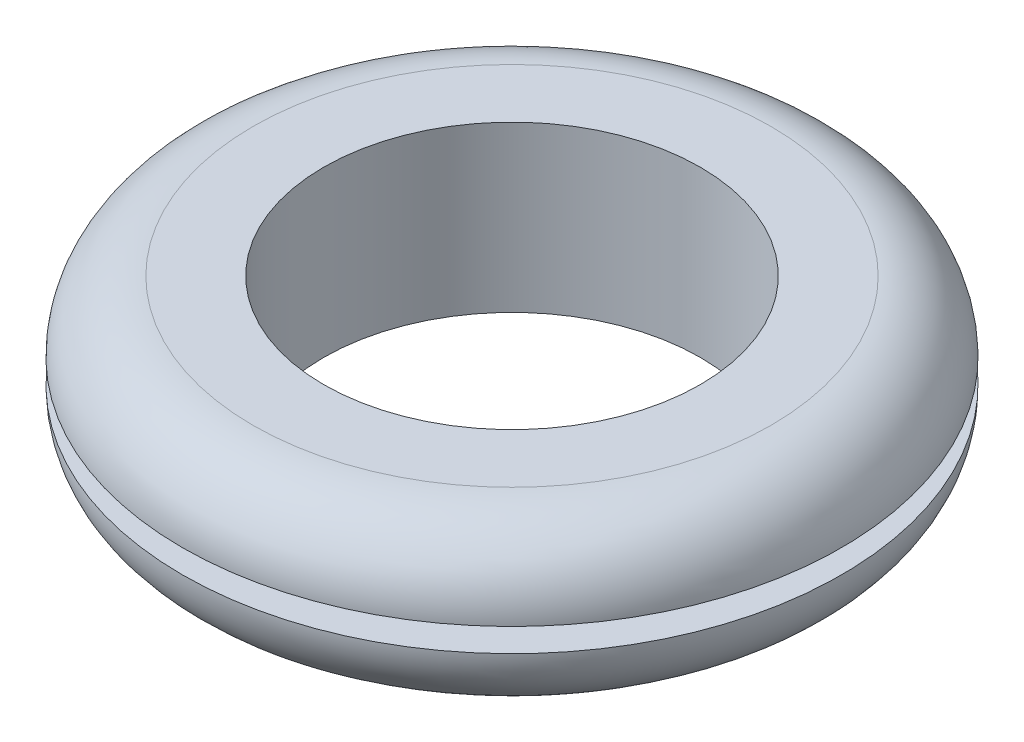
ISO-10303-21;
HEADER;
FILE_DESCRIPTION(('STEP AP214'),'2;1');
FILE_NAME('part.step','',(''),(''),'','','');
FILE_SCHEMA(('AUTOMOTIVE_DESIGN { 1 0 10303 214 1 1 1 1 }'));
ENDSEC;
DATA;
#1=APPLICATION_CONTEXT('core data for automotive mechanical design processes');
#2=APPLICATION_PROTOCOL_DEFINITION('international standard','automotive_design',2000,#1);
#3=PRODUCT_CONTEXT('',#1,'mechanical');
#4=PRODUCT('Part','Part','',(#3));
#5=PRODUCT_RELATED_PRODUCT_CATEGORY('part','',(#4));
#6=PRODUCT_DEFINITION_FORMATION('','',#4);
#7=PRODUCT_DEFINITION_CONTEXT('part definition',#1,'design');
#8=PRODUCT_DEFINITION('design','',#6,#7);
#9=PRODUCT_DEFINITION_SHAPE('','',#8);
#10=(LENGTH_UNIT() NAMED_UNIT(*) SI_UNIT(.MILLI.,.METRE.));
#11=(NAMED_UNIT(*) PLANE_ANGLE_UNIT() SI_UNIT($,.RADIAN.));
#12=(NAMED_UNIT(*) SI_UNIT($,.STERADIAN.) SOLID_ANGLE_UNIT());
#13=UNCERTAINTY_MEASURE_WITH_UNIT(LENGTH_MEASURE(1.E-05),#10,'distance_accuracy_value','');
#14=(GEOMETRIC_REPRESENTATION_CONTEXT(3) GLOBAL_UNCERTAINTY_ASSIGNED_CONTEXT((#13)) GLOBAL_UNIT_ASSIGNED_CONTEXT((#10,
#11,#12)) REPRESENTATION_CONTEXT('',''));
#15=CARTESIAN_POINT('',(0.,0.,0.));
#16=DIRECTION('',(0.,0.,1.));
#17=DIRECTION('',(1.,0.,0.));
#18=AXIS2_PLACEMENT_3D('',#15,#16,#17);
#19=CARTESIAN_POINT('',(0.,-5.55625,12.7));
#20=DIRECTION('',(0.,1.,0.));
#21=DIRECTION('',(0.,0.,1.));
#22=AXIS2_PLACEMENT_3D('',#19,#20,#21);
#23=PLANE('',#22);
#24=CARTESIAN_POINT('',(0.,-5.55625,0.));
#25=DIRECTION('',(0.,-1.,0.));
#26=DIRECTION('',(0.,0.,-1.));
#27=AXIS2_PLACEMENT_3D('',#24,#25,#26);
#28=CIRCLE('',#27,12.7);
#29=CARTESIAN_POINT('',(0.,-5.55625,-12.7));
#30=VERTEX_POINT('',#29);
#31=EDGE_CURVE('E10',#30,#30,#28,.T.);
#32=ORIENTED_EDGE('',*,*,#31,.F.);
#33=EDGE_LOOP('',(#32));
#34=FACE_BOUND('',#33,.T.);
#35=CARTESIAN_POINT('',(0.,-5.55625,0.));
#36=DIRECTION('',(0.,-1.,0.));
#37=DIRECTION('',(0.,0.,-1.));
#38=AXIS2_PLACEMENT_3D('',#35,#36,#37);
#39=CIRCLE('',#38,17.4625);
#40=CARTESIAN_POINT('',(0.,-5.55625,-17.4625));
#41=VERTEX_POINT('',#40);
#42=EDGE_CURVE('E58',#41,#41,#39,.T.);
#43=ORIENTED_EDGE('',*,*,#42,.T.);
#44=EDGE_LOOP('',(#43));
#45=FACE_BOUND('',#44,.T.);
#46=ADVANCED_FACE('F30',(#34,#45),#23,.F.);
#47=CARTESIAN_POINT('',(0.,-5.55625,0.));
#48=DIRECTION('',(0.,-1.,0.));
#49=DIRECTION('',(0.,0.,-1.));
#50=AXIS2_PLACEMENT_3D('',#47,#48,#49);
#51=CYLINDRICAL_SURFACE('',#50,12.7);
#52=CARTESIAN_POINT('',(0.,5.55625,0.));
#53=DIRECTION('',(0.,-1.,0.));
#54=DIRECTION('',(0.,0.,-1.));
#55=AXIS2_PLACEMENT_3D('',#52,#53,#54);
#56=CIRCLE('',#55,12.7);
#57=CARTESIAN_POINT('',(0.,5.55625,-12.7));
#58=VERTEX_POINT('',#57);
#59=EDGE_CURVE('E36',#58,#58,#56,.T.);
#60=ORIENTED_EDGE('',*,*,#59,.F.);
#61=EDGE_LOOP('',(#60));
#62=FACE_BOUND('',#61,.T.);
#63=ORIENTED_EDGE('',*,*,#31,.T.);
#64=EDGE_LOOP('',(#63));
#65=FACE_BOUND('',#64,.T.);
#66=ADVANCED_FACE('F95',(#62,#65),#51,.F.);
#67=CARTESIAN_POINT('',(0.,5.55625,12.7));
#68=DIRECTION('',(0.,-1.,0.));
#69=DIRECTION('',(0.,0.,-1.));
#70=AXIS2_PLACEMENT_3D('',#67,#68,#69);
#71=PLANE('',#70);
#72=CARTESIAN_POINT('',(0.,5.55625,0.));
#73=DIRECTION('',(0.,-1.,0.));
#74=DIRECTION('',(0.,0.,-1.));
#75=AXIS2_PLACEMENT_3D('',#72,#73,#74);
#76=CIRCLE('',#75,17.4625);
#77=CARTESIAN_POINT('',(0.,5.55625,-17.4625));
#78=VERTEX_POINT('',#77);
#79=EDGE_CURVE('E40',#78,#78,#76,.T.);
#80=ORIENTED_EDGE('',*,*,#79,.F.);
#81=EDGE_LOOP('',(#80));
#82=FACE_BOUND('',#81,.T.);
#83=ORIENTED_EDGE('',*,*,#59,.T.);
#84=EDGE_LOOP('',(#83));
#85=FACE_BOUND('',#84,.T.);
#86=ADVANCED_FACE('F90',(#82,#85),#71,.F.);
#87=CARTESIAN_POINT('',(0.,0.79375,0.));
#88=DIRECTION('',(0.,-1.,0.));
#89=DIRECTION('',(0.,0.,-1.));
#90=AXIS2_PLACEMENT_3D('',#87,#88,#89);
#91=TOROIDAL_SURFACE('',#90,17.4625,4.7625);
#92=CARTESIAN_POINT('',(0.,0.79375,0.));
#93=DIRECTION('',(0.,-1.,0.));
#94=DIRECTION('',(0.,0.,-1.));
#95=AXIS2_PLACEMENT_3D('',#92,#93,#94);
#96=CIRCLE('',#95,22.225);
#97=CARTESIAN_POINT('',(0.,0.79375,-22.225));
#98=VERTEX_POINT('',#97);
#99=EDGE_CURVE('E44',#98,#98,#96,.T.);
#100=ORIENTED_EDGE('',*,*,#99,.F.);
#101=EDGE_LOOP('',(#100));
#102=FACE_BOUND('',#101,.T.);
#103=ORIENTED_EDGE('',*,*,#79,.T.);
#104=EDGE_LOOP('',(#103));
#105=FACE_BOUND('',#104,.T.);
#106=ADVANCED_FACE('F84',(#102,#105),#91,.T.);
#107=CARTESIAN_POINT('',(0.,0.79375,17.4625));
#108=DIRECTION('',(0.,1.,0.));
#109=DIRECTION('',(0.,0.,1.));
#110=AXIS2_PLACEMENT_3D('',#107,#108,#109);
#111=PLANE('',#110);
#112=CARTESIAN_POINT('',(0.,0.79375,0.));
#113=DIRECTION('',(0.,-1.,0.));
#114=DIRECTION('',(0.,0.,-1.));
#115=AXIS2_PLACEMENT_3D('',#112,#113,#114);
#116=CIRCLE('',#115,17.4625);
#117=CARTESIAN_POINT('',(0.,0.79375,-17.4625));
#118=VERTEX_POINT('',#117);
#119=EDGE_CURVE('E49',#118,#118,#116,.T.);
#120=ORIENTED_EDGE('',*,*,#119,.F.);
#121=EDGE_LOOP('',(#120));
#122=FACE_BOUND('',#121,.T.);
#123=ORIENTED_EDGE('',*,*,#99,.T.);
#124=EDGE_LOOP('',(#123));
#125=FACE_BOUND('',#124,.T.);
#126=ADVANCED_FACE('F78',(#122,#125),#111,.F.);
#127=CARTESIAN_POINT('',(0.,-5.55625,0.));
#128=DIRECTION('',(0.,-1.,0.));
#129=DIRECTION('',(0.,0.,-1.));
#130=AXIS2_PLACEMENT_3D('',#127,#128,#129);
#131=CYLINDRICAL_SURFACE('',#130,17.4625);
#132=CARTESIAN_POINT('',(0.,-0.79375,0.));
#133=DIRECTION('',(0.,-1.,0.));
#134=DIRECTION('',(0.,0.,-1.));
#135=AXIS2_PLACEMENT_3D('',#132,#133,#134);
#136=CIRCLE('',#135,17.4625);
#137=CARTESIAN_POINT('',(0.,-0.79375,-17.4625));
#138=VERTEX_POINT('',#137);
#139=EDGE_CURVE('E52',#138,#138,#136,.T.);
#140=ORIENTED_EDGE('',*,*,#139,.F.);
#141=EDGE_LOOP('',(#140));
#142=FACE_BOUND('',#141,.T.);
#143=ORIENTED_EDGE('',*,*,#119,.T.);
#144=EDGE_LOOP('',(#143));
#145=FACE_BOUND('',#144,.T.);
#146=ADVANCED_FACE('F72',(#142,#145),#131,.T.);
#147=CARTESIAN_POINT('',(0.,-0.79375,17.4625));
#148=DIRECTION('',(0.,-1.,0.));
#149=DIRECTION('',(0.,0.,-1.));
#150=AXIS2_PLACEMENT_3D('',#147,#148,#149);
#151=PLANE('',#150);
#152=CARTESIAN_POINT('',(0.,-0.79375,0.));
#153=DIRECTION('',(0.,-1.,0.));
#154=DIRECTION('',(0.,0.,-1.));
#155=AXIS2_PLACEMENT_3D('',#152,#153,#154);
#156=CIRCLE('',#155,22.225);
#157=CARTESIAN_POINT('',(0.,-0.79375,-22.225));
#158=VERTEX_POINT('',#157);
#159=EDGE_CURVE('E55',#158,#158,#156,.T.);
#160=ORIENTED_EDGE('',*,*,#159,.F.);
#161=EDGE_LOOP('',(#160));
#162=FACE_BOUND('',#161,.T.);
#163=ORIENTED_EDGE('',*,*,#139,.T.);
#164=EDGE_LOOP('',(#163));
#165=FACE_BOUND('',#164,.T.);
#166=ADVANCED_FACE('F66',(#162,#165),#151,.F.);
#167=CARTESIAN_POINT('',(0.,-0.793749999999998,0.));
#168=DIRECTION('',(0.,-1.,0.));
#169=DIRECTION('',(0.,0.,-1.));
#170=AXIS2_PLACEMENT_3D('',#167,#168,#169);
#171=TOROIDAL_SURFACE('',#170,17.4625,4.7625);
#172=ORIENTED_EDGE('',*,*,#42,.F.);
#173=EDGE_LOOP('',(#172));
#174=FACE_BOUND('',#173,.T.);
#175=ORIENTED_EDGE('',*,*,#159,.T.);
#176=EDGE_LOOP('',(#175));
#177=FACE_BOUND('',#176,.T.);
#178=ADVANCED_FACE('F63',(#174,#177),#171,.T.);
#179=CLOSED_SHELL('',(#46,#66,#86,#106,#126,#146,#166,#178));
#180=MANIFOLD_SOLID_BREP('B2',#179);
#181=ADVANCED_BREP_SHAPE_REPRESENTATION('',(#18,#180),#14);
#182=SHAPE_DEFINITION_REPRESENTATION(#9,#181);
ENDSEC;
END-ISO-10303-21;
